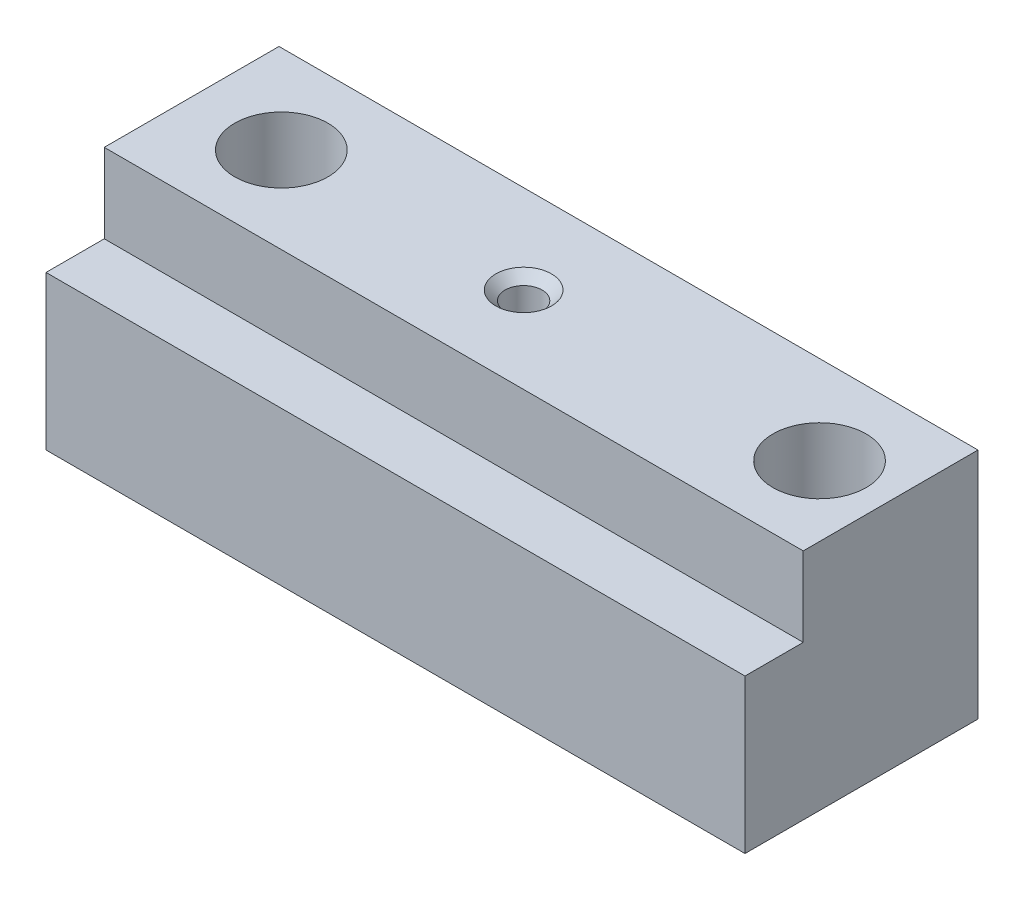
ISO-10303-21;
HEADER;
FILE_DESCRIPTION(('STEP AP214'),'2;1');
FILE_NAME('part.step','',(''),(''),'','','');
FILE_SCHEMA(('AUTOMOTIVE_DESIGN { 1 0 10303 214 1 1 1 1 }'));
ENDSEC;
DATA;
#1=APPLICATION_CONTEXT('core data for automotive mechanical design processes');
#2=APPLICATION_PROTOCOL_DEFINITION('international standard','automotive_design',2000,#1);
#3=PRODUCT_CONTEXT('',#1,'mechanical');
#4=PRODUCT('Part','Part','',(#3));
#5=PRODUCT_RELATED_PRODUCT_CATEGORY('part','',(#4));
#6=PRODUCT_DEFINITION_FORMATION('','',#4);
#7=PRODUCT_DEFINITION_CONTEXT('part definition',#1,'design');
#8=PRODUCT_DEFINITION('design','',#6,#7);
#9=PRODUCT_DEFINITION_SHAPE('','',#8);
#10=(LENGTH_UNIT() NAMED_UNIT(*) SI_UNIT(.MILLI.,.METRE.));
#11=(NAMED_UNIT(*) PLANE_ANGLE_UNIT() SI_UNIT($,.RADIAN.));
#12=(NAMED_UNIT(*) SI_UNIT($,.STERADIAN.) SOLID_ANGLE_UNIT());
#13=UNCERTAINTY_MEASURE_WITH_UNIT(LENGTH_MEASURE(1.E-05),#10,'distance_accuracy_value','');
#14=(GEOMETRIC_REPRESENTATION_CONTEXT(3) GLOBAL_UNCERTAINTY_ASSIGNED_CONTEXT((#13)) GLOBAL_UNIT_ASSIGNED_CONTEXT((#10,
#11,#12)) REPRESENTATION_CONTEXT('',''));
#15=CARTESIAN_POINT('',(0.,0.,0.));
#16=DIRECTION('',(0.,0.,1.));
#17=DIRECTION('',(1.,0.,0.));
#18=AXIS2_PLACEMENT_3D('',#15,#16,#17);
#19=CARTESIAN_POINT('',(-38.1,8.636,0.));
#20=DIRECTION('',(0.,0.,1.));
#21=DIRECTION('',(0.,-1.,0.));
#22=AXIS2_PLACEMENT_3D('',#19,#20,#21);
#23=PLANE('',#22);
#24=DIRECTION('',(1.,0.,0.));
#25=VECTOR('',#24,1.);
#26=CARTESIAN_POINT('',(-38.1,0.,0.));
#27=LINE('',#26,#25);
#28=CARTESIAN_POINT('',(-38.1,0.,0.));
#29=VERTEX_POINT('',#28);
#30=CARTESIAN_POINT('',(38.1,0.,0.));
#31=VERTEX_POINT('',#30);
#32=EDGE_CURVE('E87',#29,#31,#27,.T.);
#33=ORIENTED_EDGE('',*,*,#32,.T.);
#34=DIRECTION('',(0.,-1.,0.));
#35=VECTOR('',#34,1.);
#36=CARTESIAN_POINT('',(38.1,8.636,0.));
#37=LINE('',#36,#35);
#38=CARTESIAN_POINT('',(38.1,8.636,0.));
#39=VERTEX_POINT('',#38);
#40=EDGE_CURVE('E90',#39,#31,#37,.T.);
#41=ORIENTED_EDGE('',*,*,#40,.F.);
#42=DIRECTION('',(1.,0.,0.));
#43=VECTOR('',#42,1.);
#44=CARTESIAN_POINT('',(-38.1,8.636,0.));
#45=LINE('',#44,#43);
#46=CARTESIAN_POINT('',(-38.1,8.636,0.));
#47=VERTEX_POINT('',#46);
#48=EDGE_CURVE('E50',#47,#39,#45,.T.);
#49=ORIENTED_EDGE('',*,*,#48,.F.);
#50=DIRECTION('',(0.,-1.,0.));
#51=VECTOR('',#50,1.);
#52=CARTESIAN_POINT('',(-38.1,8.636,0.));
#53=LINE('',#52,#51);
#54=EDGE_CURVE('E91',#47,#29,#53,.T.);
#55=ORIENTED_EDGE('',*,*,#54,.T.);
#56=EDGE_LOOP('',(#33,#41,#49,#55));
#57=FACE_BOUND('',#56,.T.);
#58=ADVANCED_FACE('F35',(#57),#23,.T.);
#59=CARTESIAN_POINT('',(-38.1,8.636,-19.05));
#60=DIRECTION('',(0.,1.,0.));
#61=DIRECTION('',(0.,0.,1.));
#62=AXIS2_PLACEMENT_3D('',#59,#60,#61);
#63=PLANE('',#62);
#64=CARTESIAN_POINT('',(-1.778,8.636,-9.398));
#65=DIRECTION('',(0.,1.,0.));
#66=DIRECTION('',(0.,0.,1.));
#67=AXIS2_PLACEMENT_3D('',#64,#65,#66);
#68=CIRCLE('',#67,3.03529999999996);
#69=CARTESIAN_POINT('',(-1.778,8.636,-6.36270000000004));
#70=VERTEX_POINT('',#69);
#71=EDGE_CURVE('E146',#70,#70,#68,.F.);
#72=ORIENTED_EDGE('',*,*,#71,.T.);
#73=EDGE_LOOP('',(#72));
#74=FACE_BOUND('',#73,.T.);
#75=CARTESIAN_POINT('',(30.48,8.636,-9.398));
#76=DIRECTION('',(0.,1.,0.));
#77=DIRECTION('',(0.,0.,1.));
#78=AXIS2_PLACEMENT_3D('',#75,#76,#77);
#79=CIRCLE('',#78,5.07999999999999);
#80=CARTESIAN_POINT('',(30.48,8.636,-4.318));
#81=VERTEX_POINT('',#80);
#82=EDGE_CURVE('E302',#81,#81,#79,.T.);
#83=ORIENTED_EDGE('',*,*,#82,.F.);
#84=EDGE_LOOP('',(#83));
#85=FACE_BOUND('',#84,.T.);
#86=CARTESIAN_POINT('',(-28.194,8.636,-9.398));
#87=DIRECTION('',(0.,1.,0.));
#88=DIRECTION('',(0.,0.,1.));
#89=AXIS2_PLACEMENT_3D('',#86,#87,#88);
#90=CIRCLE('',#89,5.08);
#91=CARTESIAN_POINT('',(-28.194,8.636,-4.318));
#92=VERTEX_POINT('',#91);
#93=EDGE_CURVE('E113',#92,#92,#90,.T.);
#94=ORIENTED_EDGE('',*,*,#93,.F.);
#95=EDGE_LOOP('',(#94));
#96=FACE_BOUND('',#95,.T.);
#97=ORIENTED_EDGE('',*,*,#48,.T.);
#98=DIRECTION('',(0.,0.,1.));
#99=VECTOR('',#98,1.);
#100=CARTESIAN_POINT('',(38.1,8.636,-19.05));
#101=LINE('',#100,#99);
#102=CARTESIAN_POINT('',(38.1,8.636,-19.05));
#103=VERTEX_POINT('',#102);
#104=EDGE_CURVE('E109',#103,#39,#101,.T.);
#105=ORIENTED_EDGE('',*,*,#104,.F.);
#106=DIRECTION('',(1.,0.,0.));
#107=VECTOR('',#106,1.);
#108=CARTESIAN_POINT('',(-38.1,8.636,-19.05));
#109=LINE('',#108,#107);
#110=CARTESIAN_POINT('',(-38.1,8.636,-19.05));
#111=VERTEX_POINT('',#110);
#112=EDGE_CURVE('E58',#111,#103,#109,.T.);
#113=ORIENTED_EDGE('',*,*,#112,.F.);
#114=DIRECTION('',(0.,0.,1.));
#115=VECTOR('',#114,1.);
#116=CARTESIAN_POINT('',(-38.1,8.636,-19.05));
#117=LINE('',#116,#115);
#118=EDGE_CURVE('E96',#111,#47,#117,.T.);
#119=ORIENTED_EDGE('',*,*,#118,.T.);
#120=EDGE_LOOP('',(#97,#105,#113,#119));
#121=FACE_BOUND('',#120,.T.);
#122=ADVANCED_FACE('F164',(#74,#85,#96,#121),#63,.T.);
#123=CARTESIAN_POINT('',(-38.1,-16.764,-19.05));
#124=DIRECTION('',(0.,0.,-1.));
#125=DIRECTION('',(0.,1.,0.));
#126=AXIS2_PLACEMENT_3D('',#123,#124,#125);
#127=PLANE('',#126);
#128=ORIENTED_EDGE('',*,*,#112,.T.);
#129=DIRECTION('',(0.,1.,0.));
#130=VECTOR('',#129,1.);
#131=CARTESIAN_POINT('',(38.1,-16.764,-19.05));
#132=LINE('',#131,#130);
#133=CARTESIAN_POINT('',(38.1,-16.764,-19.05));
#134=VERTEX_POINT('',#133);
#135=EDGE_CURVE('E121',#134,#103,#132,.T.);
#136=ORIENTED_EDGE('',*,*,#135,.F.);
#137=DIRECTION('',(1.,0.,0.));
#138=VECTOR('',#137,1.);
#139=CARTESIAN_POINT('',(-38.1,-16.764,-19.05));
#140=LINE('',#139,#138);
#141=CARTESIAN_POINT('',(-38.1,-16.764,-19.05));
#142=VERTEX_POINT('',#141);
#143=EDGE_CURVE('E139',#142,#134,#140,.T.);
#144=ORIENTED_EDGE('',*,*,#143,.F.);
#145=DIRECTION('',(0.,1.,0.));
#146=VECTOR('',#145,1.);
#147=CARTESIAN_POINT('',(-38.1,-16.764,-19.05));
#148=LINE('',#147,#146);
#149=EDGE_CURVE('E133',#142,#111,#148,.T.);
#150=ORIENTED_EDGE('',*,*,#149,.T.);
#151=EDGE_LOOP('',(#128,#136,#144,#150));
#152=FACE_BOUND('',#151,.T.);
#153=ADVANCED_FACE('F169',(#152),#127,.T.);
#154=CARTESIAN_POINT('',(-38.1,-16.764,6.35));
#155=DIRECTION('',(0.,-1.,0.));
#156=DIRECTION('',(0.,0.,-1.));
#157=AXIS2_PLACEMENT_3D('',#154,#155,#156);
#158=PLANE('',#157);
#159=CARTESIAN_POINT('',(-1.778,-16.764,-9.398));
#160=DIRECTION('',(0.,-1.,0.));
#161=DIRECTION('',(0.,0.,-1.));
#162=AXIS2_PLACEMENT_3D('',#159,#160,#161);
#163=CIRCLE('',#162,3.03529999999999);
#164=CARTESIAN_POINT('',(-1.778,-16.764,-12.4333));
#165=VERTEX_POINT('',#164);
#166=EDGE_CURVE('E43',#165,#165,#163,.F.);
#167=ORIENTED_EDGE('',*,*,#166,.T.);
#168=EDGE_LOOP('',(#167));
#169=FACE_BOUND('',#168,.T.);
#170=ORIENTED_EDGE('',*,*,#143,.T.);
#171=DIRECTION('',(0.,0.,-1.));
#172=VECTOR('',#171,1.);
#173=CARTESIAN_POINT('',(38.1,-16.764,6.35));
#174=LINE('',#173,#172);
#175=CARTESIAN_POINT('',(38.1,-16.764,6.35));
#176=VERTEX_POINT('',#175);
#177=EDGE_CURVE('E118',#176,#134,#174,.T.);
#178=ORIENTED_EDGE('',*,*,#177,.F.);
#179=DIRECTION('',(1.,0.,0.));
#180=VECTOR('',#179,1.);
#181=CARTESIAN_POINT('',(-38.1,-16.764,6.35));
#182=LINE('',#181,#180);
#183=CARTESIAN_POINT('',(-38.1,-16.764,6.35));
#184=VERTEX_POINT('',#183);
#185=EDGE_CURVE('E141',#184,#176,#182,.T.);
#186=ORIENTED_EDGE('',*,*,#185,.F.);
#187=DIRECTION('',(0.,0.,-1.));
#188=VECTOR('',#187,1.);
#189=CARTESIAN_POINT('',(-38.1,-16.764,6.35));
#190=LINE('',#189,#188);
#191=EDGE_CURVE('E130',#184,#142,#190,.T.);
#192=ORIENTED_EDGE('',*,*,#191,.T.);
#193=EDGE_LOOP('',(#170,#178,#186,#192));
#194=FACE_BOUND('',#193,.T.);
#195=ADVANCED_FACE('F151',(#169,#194),#158,.T.);
#196=CARTESIAN_POINT('',(-38.1,0.,6.35));
#197=DIRECTION('',(0.,0.,1.));
#198=DIRECTION('',(0.,-1.,0.));
#199=AXIS2_PLACEMENT_3D('',#196,#197,#198);
#200=PLANE('',#199);
#201=ORIENTED_EDGE('',*,*,#185,.T.);
#202=DIRECTION('',(0.,-1.,0.));
#203=VECTOR('',#202,1.);
#204=CARTESIAN_POINT('',(38.1,0.,6.35));
#205=LINE('',#204,#203);
#206=CARTESIAN_POINT('',(38.1,0.,6.35));
#207=VERTEX_POINT('',#206);
#208=EDGE_CURVE('E104',#207,#176,#205,.T.);
#209=ORIENTED_EDGE('',*,*,#208,.F.);
#210=DIRECTION('',(1.,0.,0.));
#211=VECTOR('',#210,1.);
#212=CARTESIAN_POINT('',(-38.1,0.,6.35));
#213=LINE('',#212,#211);
#214=CARTESIAN_POINT('',(-38.1,0.,6.35));
#215=VERTEX_POINT('',#214);
#216=EDGE_CURVE('E95',#215,#207,#213,.T.);
#217=ORIENTED_EDGE('',*,*,#216,.F.);
#218=DIRECTION('',(0.,-1.,0.));
#219=VECTOR('',#218,1.);
#220=CARTESIAN_POINT('',(-38.1,0.,6.35));
#221=LINE('',#220,#219);
#222=EDGE_CURVE('E127',#215,#184,#221,.T.);
#223=ORIENTED_EDGE('',*,*,#222,.T.);
#224=EDGE_LOOP('',(#201,#209,#217,#223));
#225=FACE_BOUND('',#224,.T.);
#226=ADVANCED_FACE('F176',(#225),#200,.T.);
#227=CARTESIAN_POINT('',(-38.1,0.,0.));
#228=DIRECTION('',(0.,1.,0.));
#229=DIRECTION('',(0.,0.,1.));
#230=AXIS2_PLACEMENT_3D('',#227,#228,#229);
#231=PLANE('',#230);
#232=ORIENTED_EDGE('',*,*,#216,.T.);
#233=DIRECTION('',(0.,0.,1.));
#234=VECTOR('',#233,1.);
#235=CARTESIAN_POINT('',(38.1,0.,0.));
#236=LINE('',#235,#234);
#237=EDGE_CURVE('E99',#31,#207,#236,.T.);
#238=ORIENTED_EDGE('',*,*,#237,.F.);
#239=ORIENTED_EDGE('',*,*,#32,.F.);
#240=DIRECTION('',(0.,0.,1.));
#241=VECTOR('',#240,1.);
#242=CARTESIAN_POINT('',(-38.1,0.,0.));
#243=LINE('',#242,#241);
#244=EDGE_CURVE('E125',#29,#215,#243,.T.);
#245=ORIENTED_EDGE('',*,*,#244,.T.);
#246=EDGE_LOOP('',(#232,#238,#239,#245));
#247=FACE_BOUND('',#246,.T.);
#248=ADVANCED_FACE('F100',(#247),#231,.T.);
#249=CARTESIAN_POINT('',(-38.1,0.,0.));
#250=DIRECTION('',(-1.,0.,0.));
#251=DIRECTION('',(0.,0.,1.));
#252=AXIS2_PLACEMENT_3D('',#249,#250,#251);
#253=PLANE('',#252);
#254=ORIENTED_EDGE('',*,*,#54,.F.);
#255=ORIENTED_EDGE('',*,*,#118,.F.);
#256=ORIENTED_EDGE('',*,*,#149,.F.);
#257=ORIENTED_EDGE('',*,*,#191,.F.);
#258=ORIENTED_EDGE('',*,*,#222,.F.);
#259=ORIENTED_EDGE('',*,*,#244,.F.);
#260=EDGE_LOOP('',(#254,#255,#256,#257,#258,#259));
#261=FACE_BOUND('',#260,.T.);
#262=ADVANCED_FACE('F175',(#261),#253,.T.);
#263=CARTESIAN_POINT('',(38.1,0.,0.));
#264=DIRECTION('',(-1.,0.,0.));
#265=DIRECTION('',(0.,0.,1.));
#266=AXIS2_PLACEMENT_3D('',#263,#264,#265);
#267=PLANE('',#266);
#268=ORIENTED_EDGE('',*,*,#40,.T.);
#269=ORIENTED_EDGE('',*,*,#237,.T.);
#270=ORIENTED_EDGE('',*,*,#208,.T.);
#271=ORIENTED_EDGE('',*,*,#177,.T.);
#272=ORIENTED_EDGE('',*,*,#135,.T.);
#273=ORIENTED_EDGE('',*,*,#104,.T.);
#274=EDGE_LOOP('',(#268,#269,#270,#271,#272,#273));
#275=FACE_BOUND('',#274,.T.);
#276=ADVANCED_FACE('F107',(#275),#267,.F.);
#277=CARTESIAN_POINT('',(-28.194,-10.414,-9.398));
#278=DIRECTION('',(0.,1.,0.));
#279=DIRECTION('',(0.,0.,1.));
#280=AXIS2_PLACEMENT_3D('',#277,#278,#279);
#281=CYLINDRICAL_SURFACE('',#280,5.08);
#282=CARTESIAN_POINT('',(-28.194,-10.414,-9.398));
#283=DIRECTION('',(0.,1.,0.));
#284=DIRECTION('',(0.,0.,1.));
#285=AXIS2_PLACEMENT_3D('',#282,#283,#284);
#286=CIRCLE('',#285,5.08);
#287=CARTESIAN_POINT('',(-28.194,-10.414,-4.318));
#288=VERTEX_POINT('',#287);
#289=EDGE_CURVE('E110',#288,#288,#286,.T.);
#290=ORIENTED_EDGE('',*,*,#289,.F.);
#291=EDGE_LOOP('',(#290));
#292=FACE_BOUND('',#291,.T.);
#293=ORIENTED_EDGE('',*,*,#93,.T.);
#294=EDGE_LOOP('',(#293));
#295=FACE_BOUND('',#294,.T.);
#296=ADVANCED_FACE('F190',(#292,#295),#281,.F.);
#297=CARTESIAN_POINT('',(-28.194,-10.414,-9.398));
#298=DIRECTION('',(0.,1.,0.));
#299=DIRECTION('',(0.,0.,1.));
#300=AXIS2_PLACEMENT_3D('',#297,#298,#299);
#301=PLANE('',#300);
#302=ORIENTED_EDGE('',*,*,#289,.T.);
#303=EDGE_LOOP('',(#302));
#304=FACE_BOUND('',#303,.T.);
#305=ADVANCED_FACE('F193',(#304),#301,.T.);
#306=CARTESIAN_POINT('',(30.48,-10.414,-9.398));
#307=DIRECTION('',(0.,1.,0.));
#308=DIRECTION('',(0.,0.,1.));
#309=AXIS2_PLACEMENT_3D('',#306,#307,#308);
#310=CYLINDRICAL_SURFACE('',#309,5.07999999999999);
#311=CARTESIAN_POINT('',(30.48,-10.414,-9.398));
#312=DIRECTION('',(0.,1.,0.));
#313=DIRECTION('',(0.,0.,1.));
#314=AXIS2_PLACEMENT_3D('',#311,#312,#313);
#315=CIRCLE('',#314,5.07999999999999);
#316=CARTESIAN_POINT('',(30.48,-10.414,-4.318));
#317=VERTEX_POINT('',#316);
#318=EDGE_CURVE('E301',#317,#317,#315,.T.);
#319=ORIENTED_EDGE('',*,*,#318,.F.);
#320=EDGE_LOOP('',(#319));
#321=FACE_BOUND('',#320,.T.);
#322=ORIENTED_EDGE('',*,*,#82,.T.);
#323=EDGE_LOOP('',(#322));
#324=FACE_BOUND('',#323,.T.);
#325=ADVANCED_FACE('F197',(#321,#324),#310,.F.);
#326=CARTESIAN_POINT('',(30.48,-10.414,-9.398));
#327=DIRECTION('',(0.,1.,0.));
#328=DIRECTION('',(0.,0.,1.));
#329=AXIS2_PLACEMENT_3D('',#326,#327,#328);
#330=PLANE('',#329);
#331=ORIENTED_EDGE('',*,*,#318,.T.);
#332=EDGE_LOOP('',(#331));
#333=FACE_BOUND('',#332,.T.);
#334=ADVANCED_FACE('F201',(#333),#330,.T.);
#335=CARTESIAN_POINT('',(-1.778,8.636,-9.398));
#336=DIRECTION('',(0.,1.,0.));
#337=DIRECTION('',(0.,0.,1.));
#338=AXIS2_PLACEMENT_3D('',#335,#336,#337);
#339=CYLINDRICAL_SURFACE('',#338,2.01929999999999);
#340=CARTESIAN_POINT('',(-1.778,-15.748,-9.398));
#341=DIRECTION('',(0.,-1.,0.));
#342=DIRECTION('',(0.,0.,-1.));
#343=AXIS2_PLACEMENT_3D('',#340,#341,#342);
#344=CIRCLE('',#343,2.01929999999999);
#345=CARTESIAN_POINT('',(-1.778,-15.748,-11.4173));
#346=VERTEX_POINT('',#345);
#347=EDGE_CURVE('E11',#346,#346,#344,.T.);
#348=ORIENTED_EDGE('',*,*,#347,.T.);
#349=EDGE_LOOP('',(#348));
#350=FACE_BOUND('',#349,.T.);
#351=CARTESIAN_POINT('',(-1.778,7.62000000000003,-9.398));
#352=DIRECTION('',(0.,1.,0.));
#353=DIRECTION('',(0.,0.,1.));
#354=AXIS2_PLACEMENT_3D('',#351,#352,#353);
#355=CIRCLE('',#354,2.01929999999999);
#356=CARTESIAN_POINT('',(-1.778,7.62000000000003,-7.37870000000001));
#357=VERTEX_POINT('',#356);
#358=EDGE_CURVE('E137',#357,#357,#355,.T.);
#359=ORIENTED_EDGE('',*,*,#358,.T.);
#360=EDGE_LOOP('',(#359));
#361=FACE_BOUND('',#360,.T.);
#362=ADVANCED_FACE('F160',(#350,#361),#339,.F.);
#363=CARTESIAN_POINT('',(-1.778,7.62000000000003,-9.398));
#364=DIRECTION('',(0.,1.,0.));
#365=DIRECTION('',(0.,0.,1.));
#366=AXIS2_PLACEMENT_3D('',#363,#364,#365);
#367=CONICAL_SURFACE('',#366,2.01929999999999,0.785398163397446);
#368=ORIENTED_EDGE('',*,*,#71,.F.);
#369=EDGE_LOOP('',(#368));
#370=FACE_BOUND('',#369,.T.);
#371=ORIENTED_EDGE('',*,*,#358,.F.);
#372=EDGE_LOOP('',(#371));
#373=FACE_BOUND('',#372,.T.);
#374=ADVANCED_FACE('F155',(#370,#373),#367,.F.);
#375=CARTESIAN_POINT('',(-1.778,-16.764,-9.398));
#376=DIRECTION('',(0.,-1.,0.));
#377=DIRECTION('',(0.,0.,-1.));
#378=AXIS2_PLACEMENT_3D('',#375,#376,#377);
#379=CONICAL_SURFACE('',#378,3.03529999999998,0.785398163397449);
#380=ORIENTED_EDGE('',*,*,#347,.F.);
#381=EDGE_LOOP('',(#380));
#382=FACE_BOUND('',#381,.T.);
#383=ORIENTED_EDGE('',*,*,#166,.F.);
#384=EDGE_LOOP('',(#383));
#385=FACE_BOUND('',#384,.T.);
#386=ADVANCED_FACE('F37',(#382,#385),#379,.F.);
#387=CLOSED_SHELL('',(#58,#122,#153,#195,#226,#248,#262,#276,#296,#305,#325,#334,#362,#374,#386));
#388=MANIFOLD_SOLID_BREP('B2',#387);
#389=ADVANCED_BREP_SHAPE_REPRESENTATION('',(#18,#388),#14);
#390=SHAPE_DEFINITION_REPRESENTATION(#9,#389);
ENDSEC;
END-ISO-10303-21;
